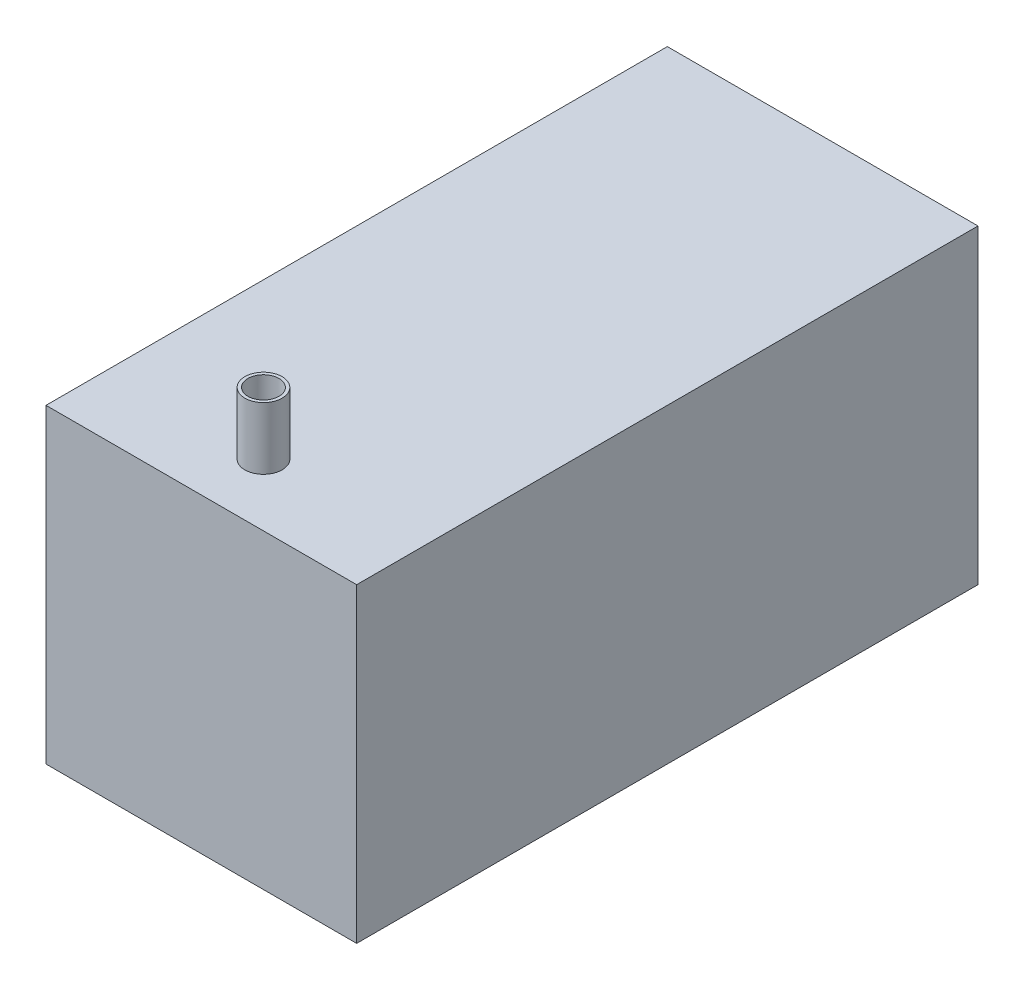
ISO-10303-21;
HEADER;
FILE_DESCRIPTION(('STEP AP214'),'2;1');
FILE_NAME('part.step','',(''),(''),'','','');
FILE_SCHEMA(('AUTOMOTIVE_DESIGN { 1 0 10303 214 1 1 1 1 }'));
ENDSEC;
DATA;
#1=APPLICATION_CONTEXT('core data for automotive mechanical design processes');
#2=APPLICATION_PROTOCOL_DEFINITION('international standard','automotive_design',2000,#1);
#3=PRODUCT_CONTEXT('',#1,'mechanical');
#4=PRODUCT('Part','Part','',(#3));
#5=PRODUCT_RELATED_PRODUCT_CATEGORY('part','',(#4));
#6=PRODUCT_DEFINITION_FORMATION('','',#4);
#7=PRODUCT_DEFINITION_CONTEXT('part definition',#1,'design');
#8=PRODUCT_DEFINITION('design','',#6,#7);
#9=PRODUCT_DEFINITION_SHAPE('','',#8);
#10=(LENGTH_UNIT() NAMED_UNIT(*) SI_UNIT(.MILLI.,.METRE.));
#11=(NAMED_UNIT(*) PLANE_ANGLE_UNIT() SI_UNIT($,.RADIAN.));
#12=(NAMED_UNIT(*) SI_UNIT($,.STERADIAN.) SOLID_ANGLE_UNIT());
#13=UNCERTAINTY_MEASURE_WITH_UNIT(LENGTH_MEASURE(1.E-05),#10,'distance_accuracy_value','');
#14=(GEOMETRIC_REPRESENTATION_CONTEXT(3) GLOBAL_UNCERTAINTY_ASSIGNED_CONTEXT((#13)) GLOBAL_UNIT_ASSIGNED_CONTEXT((#10,
#11,#12)) REPRESENTATION_CONTEXT('',''));
#15=CARTESIAN_POINT('',(0.,0.,0.));
#16=DIRECTION('',(0.,0.,1.));
#17=DIRECTION('',(1.,0.,0.));
#18=AXIS2_PLACEMENT_3D('',#15,#16,#17);
#19=CARTESIAN_POINT('',(50.,-10.,180.));
#20=DIRECTION('',(0.,1.,0.));
#21=DIRECTION('',(0.,0.,1.));
#22=AXIS2_PLACEMENT_3D('',#19,#20,#21);
#23=CYLINDRICAL_SURFACE('',#22,5.);
#24=CARTESIAN_POINT('',(50.,-0.999999999999999,180.));
#25=DIRECTION('',(0.,-1.,0.));
#26=DIRECTION('',(0.,0.,-1.));
#27=AXIS2_PLACEMENT_3D('',#24,#25,#26);
#28=CIRCLE('',#27,5.);
#29=CARTESIAN_POINT('',(50.,-0.999999999999999,175.));
#30=VERTEX_POINT('',#29);
#31=EDGE_CURVE('E188',#30,#30,#28,.T.);
#32=ORIENTED_EDGE('',*,*,#31,.T.);
#33=EDGE_LOOP('',(#32));
#34=FACE_BOUND('',#33,.T.);
#35=CARTESIAN_POINT('',(50.0000000000006,20.,179.999999999999));
#36=DIRECTION('',(0.,1.,0.));
#37=DIRECTION('',(0.,0.,1.));
#38=AXIS2_PLACEMENT_3D('',#35,#36,#37);
#39=CIRCLE('',#38,5.);
#40=CARTESIAN_POINT('',(50.0000000000006,20.,184.999999999999));
#41=VERTEX_POINT('',#40);
#42=EDGE_CURVE('E196',#41,#41,#39,.T.);
#43=ORIENTED_EDGE('',*,*,#42,.T.);
#44=EDGE_LOOP('',(#43));
#45=FACE_BOUND('',#44,.T.);
#46=ADVANCED_FACE('F63',(#34,#45),#23,.F.);
#47=CARTESIAN_POINT('',(1.,0.,199.));
#48=DIRECTION('',(1.,0.,0.));
#49=DIRECTION('',(0.,1.,0.));
#50=AXIS2_PLACEMENT_3D('',#47,#48,#49);
#51=PLANE('',#50);
#52=DIRECTION('',(0.,-1.,0.));
#53=VECTOR('',#52,1.);
#54=CARTESIAN_POINT('',(1.,0.,1.));
#55=LINE('',#54,#53);
#56=CARTESIAN_POINT('',(1.,-1.,1.));
#57=VERTEX_POINT('',#56);
#58=CARTESIAN_POINT('',(1.00000000000001,-99.,1.));
#59=VERTEX_POINT('',#58);
#60=EDGE_CURVE('E190',#57,#59,#55,.T.);
#61=ORIENTED_EDGE('',*,*,#60,.F.);
#62=DIRECTION('',(0.,0.,-1.));
#63=VECTOR('',#62,1.);
#64=CARTESIAN_POINT('',(1.,-1.,199.));
#65=LINE('',#64,#63);
#66=CARTESIAN_POINT('',(1.,-1.,199.));
#67=VERTEX_POINT('',#66);
#68=EDGE_CURVE('E158',#67,#57,#65,.T.);
#69=ORIENTED_EDGE('',*,*,#68,.F.);
#70=DIRECTION('',(0.,-1.,0.));
#71=VECTOR('',#70,1.);
#72=CARTESIAN_POINT('',(1.,0.,199.));
#73=LINE('',#72,#71);
#74=CARTESIAN_POINT('',(1.00000000000001,-99.,199.));
#75=VERTEX_POINT('',#74);
#76=EDGE_CURVE('E143',#67,#75,#73,.T.);
#77=ORIENTED_EDGE('',*,*,#76,.T.);
#78=DIRECTION('',(0.,0.,-1.));
#79=VECTOR('',#78,1.);
#80=CARTESIAN_POINT('',(1.00000000000001,-99.,199.));
#81=LINE('',#80,#79);
#82=EDGE_CURVE('E155',#75,#59,#81,.T.);
#83=ORIENTED_EDGE('',*,*,#82,.T.);
#84=EDGE_LOOP('',(#61,#69,#77,#83));
#85=FACE_BOUND('',#84,.T.);
#86=ADVANCED_FACE('F154',(#85),#51,.T.);
#87=CARTESIAN_POINT('',(0.,-99.,199.));
#88=DIRECTION('',(0.,1.,0.));
#89=DIRECTION('',(0.,0.,1.));
#90=AXIS2_PLACEMENT_3D('',#87,#88,#89);
#91=PLANE('',#90);
#92=DIRECTION('',(1.,0.,0.));
#93=VECTOR('',#92,1.);
#94=CARTESIAN_POINT('',(0.,-99.,1.));
#95=LINE('',#94,#93);
#96=CARTESIAN_POINT('',(99.,-99.,1.));
#97=VERTEX_POINT('',#96);
#98=EDGE_CURVE('E162',#59,#97,#95,.T.);
#99=ORIENTED_EDGE('',*,*,#98,.F.);
#100=ORIENTED_EDGE('',*,*,#82,.F.);
#101=DIRECTION('',(1.,0.,0.));
#102=VECTOR('',#101,1.);
#103=CARTESIAN_POINT('',(0.,-99.,199.));
#104=LINE('',#103,#102);
#105=CARTESIAN_POINT('',(99.,-99.,199.));
#106=VERTEX_POINT('',#105);
#107=EDGE_CURVE('E139',#75,#106,#104,.T.);
#108=ORIENTED_EDGE('',*,*,#107,.T.);
#109=DIRECTION('',(0.,0.,-1.));
#110=VECTOR('',#109,1.);
#111=CARTESIAN_POINT('',(99.,-99.,199.));
#112=LINE('',#111,#110);
#113=EDGE_CURVE('E164',#106,#97,#112,.T.);
#114=ORIENTED_EDGE('',*,*,#113,.T.);
#115=EDGE_LOOP('',(#99,#100,#108,#114));
#116=FACE_BOUND('',#115,.T.);
#117=ADVANCED_FACE('F161',(#116),#91,.T.);
#118=CARTESIAN_POINT('',(99.,0.,199.));
#119=DIRECTION('',(-1.,0.,0.));
#120=DIRECTION('',(0.,-1.,0.));
#121=AXIS2_PLACEMENT_3D('',#118,#119,#120);
#122=PLANE('',#121);
#123=DIRECTION('',(0.,1.,0.));
#124=VECTOR('',#123,1.);
#125=CARTESIAN_POINT('',(99.,0.,1.));
#126=LINE('',#125,#124);
#127=CARTESIAN_POINT('',(99.,-1.,1.));
#128=VERTEX_POINT('',#127);
#129=EDGE_CURVE('E207',#97,#128,#126,.T.);
#130=ORIENTED_EDGE('',*,*,#129,.F.);
#131=ORIENTED_EDGE('',*,*,#113,.F.);
#132=DIRECTION('',(0.,1.,0.));
#133=VECTOR('',#132,1.);
#134=CARTESIAN_POINT('',(99.,0.,199.));
#135=LINE('',#134,#133);
#136=CARTESIAN_POINT('',(99.,-1.,199.));
#137=VERTEX_POINT('',#136);
#138=EDGE_CURVE('E144',#106,#137,#135,.T.);
#139=ORIENTED_EDGE('',*,*,#138,.T.);
#140=DIRECTION('',(0.,0.,-1.));
#141=VECTOR('',#140,1.);
#142=CARTESIAN_POINT('',(99.,-1.,199.));
#143=LINE('',#142,#141);
#144=EDGE_CURVE('E169',#137,#128,#143,.T.);
#145=ORIENTED_EDGE('',*,*,#144,.T.);
#146=EDGE_LOOP('',(#130,#131,#139,#145));
#147=FACE_BOUND('',#146,.T.);
#148=ADVANCED_FACE('F215',(#147),#122,.T.);
#149=CARTESIAN_POINT('',(0.,-1.,199.));
#150=DIRECTION('',(0.,-1.,0.));
#151=DIRECTION('',(0.,0.,-1.));
#152=AXIS2_PLACEMENT_3D('',#149,#150,#151);
#153=PLANE('',#152);
#154=ORIENTED_EDGE('',*,*,#31,.F.);
#155=EDGE_LOOP('',(#154));
#156=FACE_BOUND('',#155,.T.);
#157=DIRECTION('',(-1.,0.,0.));
#158=VECTOR('',#157,1.);
#159=CARTESIAN_POINT('',(0.,-1.,1.));
#160=LINE('',#159,#158);
#161=EDGE_CURVE('E159',#128,#57,#160,.T.);
#162=ORIENTED_EDGE('',*,*,#161,.F.);
#163=ORIENTED_EDGE('',*,*,#144,.F.);
#164=DIRECTION('',(-1.,0.,0.));
#165=VECTOR('',#164,1.);
#166=CARTESIAN_POINT('',(0.,-1.,199.));
#167=LINE('',#166,#165);
#168=EDGE_CURVE('E204',#137,#67,#167,.T.);
#169=ORIENTED_EDGE('',*,*,#168,.T.);
#170=ORIENTED_EDGE('',*,*,#68,.T.);
#171=EDGE_LOOP('',(#162,#163,#169,#170));
#172=FACE_BOUND('',#171,.T.);
#173=ADVANCED_FACE('F217',(#156,#172),#153,.T.);
#174=CARTESIAN_POINT('',(1.00000000000001,-99.,199.));
#175=DIRECTION('',(0.,0.,1.));
#176=DIRECTION('',(1.,0.,0.));
#177=AXIS2_PLACEMENT_3D('',#174,#175,#176);
#178=PLANE('',#177);
#179=ORIENTED_EDGE('',*,*,#76,.F.);
#180=ORIENTED_EDGE('',*,*,#168,.F.);
#181=ORIENTED_EDGE('',*,*,#138,.F.);
#182=ORIENTED_EDGE('',*,*,#107,.F.);
#183=EDGE_LOOP('',(#179,#180,#181,#182));
#184=FACE_BOUND('',#183,.T.);
#185=ADVANCED_FACE('F141',(#184),#178,.F.);
#186=CARTESIAN_POINT('',(1.00000000000001,-99.,1.));
#187=DIRECTION('',(0.,0.,1.));
#188=DIRECTION('',(1.,0.,0.));
#189=AXIS2_PLACEMENT_3D('',#186,#187,#188);
#190=PLANE('',#189);
#191=ORIENTED_EDGE('',*,*,#60,.T.);
#192=ORIENTED_EDGE('',*,*,#98,.T.);
#193=ORIENTED_EDGE('',*,*,#129,.T.);
#194=ORIENTED_EDGE('',*,*,#161,.T.);
#195=EDGE_LOOP('',(#191,#192,#193,#194));
#196=FACE_BOUND('',#195,.T.);
#197=ADVANCED_FACE('F219',(#196),#190,.T.);
#198=CARTESIAN_POINT('',(50.0000000000006,20.,179.999999999999));
#199=DIRECTION('',(0.,1.,0.));
#200=DIRECTION('',(0.,0.,1.));
#201=AXIS2_PLACEMENT_3D('',#198,#199,#200);
#202=PLANE('',#201);
#203=CARTESIAN_POINT('',(50.0000000000006,20.,179.999999999999));
#204=DIRECTION('',(0.,1.,0.));
#205=DIRECTION('',(1.,0.,0.));
#206=AXIS2_PLACEMENT_3D('',#203,#204,#205);
#207=CIRCLE('',#206,6.);
#208=CARTESIAN_POINT('',(56.0000000000006,20.,179.999999999999));
#209=VERTEX_POINT('',#208);
#210=EDGE_CURVE('E191',#209,#209,#207,.T.);
#211=ORIENTED_EDGE('',*,*,#210,.T.);
#212=EDGE_LOOP('',(#211));
#213=FACE_BOUND('',#212,.T.);
#214=ORIENTED_EDGE('',*,*,#42,.F.);
#215=EDGE_LOOP('',(#214));
#216=FACE_BOUND('',#215,.T.);
#217=ADVANCED_FACE('F221',(#213,#216),#202,.T.);
#218=CARTESIAN_POINT('',(50.0000000000006,20.,179.999999999999));
#219=DIRECTION('',(0.,-1.,0.));
#220=DIRECTION('',(0.,0.,-1.));
#221=AXIS2_PLACEMENT_3D('',#218,#219,#220);
#222=CYLINDRICAL_SURFACE('',#221,6.);
#223=ORIENTED_EDGE('',*,*,#210,.F.);
#224=EDGE_LOOP('',(#223));
#225=FACE_BOUND('',#224,.T.);
#226=CARTESIAN_POINT('',(50.0000000000006,0.,179.999999999999));
#227=DIRECTION('',(0.,-1.,0.));
#228=DIRECTION('',(0.,0.,-1.));
#229=AXIS2_PLACEMENT_3D('',#226,#227,#228);
#230=CIRCLE('',#229,6.);
#231=CARTESIAN_POINT('',(50.0000000000006,0.,173.999999999999));
#232=VERTEX_POINT('',#231);
#233=EDGE_CURVE('E12',#232,#232,#230,.F.);
#234=ORIENTED_EDGE('',*,*,#233,.T.);
#235=EDGE_LOOP('',(#234));
#236=FACE_BOUND('',#235,.T.);
#237=ADVANCED_FACE('F228',(#225,#236),#222,.T.);
#238=CARTESIAN_POINT('',(0.,-100.,200.));
#239=DIRECTION('',(0.,1.,0.));
#240=DIRECTION('',(0.,0.,1.));
#241=AXIS2_PLACEMENT_3D('',#238,#239,#240);
#242=PLANE('',#241);
#243=DIRECTION('',(1.,0.,0.));
#244=VECTOR('',#243,1.);
#245=CARTESIAN_POINT('',(0.,-100.,0.));
#246=LINE('',#245,#244);
#247=CARTESIAN_POINT('',(0.,-100.,0.));
#248=VERTEX_POINT('',#247);
#249=CARTESIAN_POINT('',(100.,-100.,0.));
#250=VERTEX_POINT('',#249);
#251=EDGE_CURVE('E167',#248,#250,#246,.T.);
#252=ORIENTED_EDGE('',*,*,#251,.T.);
#253=DIRECTION('',(0.,0.,-1.));
#254=VECTOR('',#253,1.);
#255=CARTESIAN_POINT('',(100.,-100.,200.));
#256=LINE('',#255,#254);
#257=CARTESIAN_POINT('',(100.,-100.,200.));
#258=VERTEX_POINT('',#257);
#259=EDGE_CURVE('E186',#258,#250,#256,.T.);
#260=ORIENTED_EDGE('',*,*,#259,.F.);
#261=DIRECTION('',(1.,0.,0.));
#262=VECTOR('',#261,1.);
#263=CARTESIAN_POINT('',(0.,-100.,200.));
#264=LINE('',#263,#262);
#265=CARTESIAN_POINT('',(0.,-100.,200.));
#266=VERTEX_POINT('',#265);
#267=EDGE_CURVE('E112',#266,#258,#264,.T.);
#268=ORIENTED_EDGE('',*,*,#267,.F.);
#269=DIRECTION('',(0.,0.,-1.));
#270=VECTOR('',#269,1.);
#271=CARTESIAN_POINT('',(0.,-100.,200.));
#272=LINE('',#271,#270);
#273=EDGE_CURVE('E72',#266,#248,#272,.T.);
#274=ORIENTED_EDGE('',*,*,#273,.T.);
#275=EDGE_LOOP('',(#252,#260,#268,#274));
#276=FACE_BOUND('',#275,.T.);
#277=ADVANCED_FACE('F241',(#276),#242,.F.);
#278=CARTESIAN_POINT('',(100.,0.,200.));
#279=DIRECTION('',(-1.,0.,0.));
#280=DIRECTION('',(0.,-1.,0.));
#281=AXIS2_PLACEMENT_3D('',#278,#279,#280);
#282=PLANE('',#281);
#283=DIRECTION('',(0.,1.,0.));
#284=VECTOR('',#283,1.);
#285=CARTESIAN_POINT('',(100.,0.,0.));
#286=LINE('',#285,#284);
#287=CARTESIAN_POINT('',(100.,0.,0.));
#288=VERTEX_POINT('',#287);
#289=EDGE_CURVE('E98',#250,#288,#286,.T.);
#290=ORIENTED_EDGE('',*,*,#289,.T.);
#291=DIRECTION('',(0.,0.,-1.));
#292=VECTOR('',#291,1.);
#293=CARTESIAN_POINT('',(100.,0.,200.));
#294=LINE('',#293,#292);
#295=CARTESIAN_POINT('',(100.,0.,200.));
#296=VERTEX_POINT('',#295);
#297=EDGE_CURVE('E184',#296,#288,#294,.T.);
#298=ORIENTED_EDGE('',*,*,#297,.F.);
#299=DIRECTION('',(0.,1.,0.));
#300=VECTOR('',#299,1.);
#301=CARTESIAN_POINT('',(100.,0.,200.));
#302=LINE('',#301,#300);
#303=EDGE_CURVE('E176',#258,#296,#302,.T.);
#304=ORIENTED_EDGE('',*,*,#303,.F.);
#305=ORIENTED_EDGE('',*,*,#259,.T.);
#306=EDGE_LOOP('',(#290,#298,#304,#305));
#307=FACE_BOUND('',#306,.T.);
#308=ADVANCED_FACE('F246',(#307),#282,.F.);
#309=CARTESIAN_POINT('',(0.,-100.,200.));
#310=DIRECTION('',(0.,0.,1.));
#311=DIRECTION('',(1.,0.,0.));
#312=AXIS2_PLACEMENT_3D('',#309,#310,#311);
#313=PLANE('',#312);
#314=DIRECTION('',(0.,-1.,0.));
#315=VECTOR('',#314,1.);
#316=CARTESIAN_POINT('',(0.,0.,200.));
#317=LINE('',#316,#315);
#318=CARTESIAN_POINT('',(0.,0.,200.));
#319=VERTEX_POINT('',#318);
#320=EDGE_CURVE('E173',#319,#266,#317,.T.);
#321=ORIENTED_EDGE('',*,*,#320,.T.);
#322=ORIENTED_EDGE('',*,*,#267,.T.);
#323=ORIENTED_EDGE('',*,*,#303,.T.);
#324=DIRECTION('',(-1.,0.,0.));
#325=VECTOR('',#324,1.);
#326=CARTESIAN_POINT('',(0.,0.,200.));
#327=LINE('',#326,#325);
#328=EDGE_CURVE('E80',#296,#319,#327,.T.);
#329=ORIENTED_EDGE('',*,*,#328,.T.);
#330=EDGE_LOOP('',(#321,#322,#323,#329));
#331=FACE_BOUND('',#330,.T.);
#332=ADVANCED_FACE('F262',(#331),#313,.T.);
#333=CARTESIAN_POINT('',(0.,0.,200.));
#334=DIRECTION('',(1.,0.,0.));
#335=DIRECTION('',(0.,1.,0.));
#336=AXIS2_PLACEMENT_3D('',#333,#334,#335);
#337=PLANE('',#336);
#338=DIRECTION('',(0.,-1.,0.));
#339=VECTOR('',#338,1.);
#340=CARTESIAN_POINT('',(0.,0.,0.));
#341=LINE('',#340,#339);
#342=CARTESIAN_POINT('',(0.,0.,0.));
#343=VERTEX_POINT('',#342);
#344=EDGE_CURVE('E163',#343,#248,#341,.T.);
#345=ORIENTED_EDGE('',*,*,#344,.T.);
#346=ORIENTED_EDGE('',*,*,#273,.F.);
#347=ORIENTED_EDGE('',*,*,#320,.F.);
#348=DIRECTION('',(0.,0.,-1.));
#349=VECTOR('',#348,1.);
#350=CARTESIAN_POINT('',(0.,0.,200.));
#351=LINE('',#350,#349);
#352=EDGE_CURVE('E178',#319,#343,#351,.T.);
#353=ORIENTED_EDGE('',*,*,#352,.T.);
#354=EDGE_LOOP('',(#345,#346,#347,#353));
#355=FACE_BOUND('',#354,.T.);
#356=ADVANCED_FACE('F65',(#355),#337,.F.);
#357=CARTESIAN_POINT('',(0.,-100.,0.));
#358=DIRECTION('',(0.,0.,1.));
#359=DIRECTION('',(1.,0.,0.));
#360=AXIS2_PLACEMENT_3D('',#357,#358,#359);
#361=PLANE('',#360);
#362=ORIENTED_EDGE('',*,*,#344,.F.);
#363=DIRECTION('',(-1.,0.,0.));
#364=VECTOR('',#363,1.);
#365=CARTESIAN_POINT('',(0.,0.,0.));
#366=LINE('',#365,#364);
#367=EDGE_CURVE('E104',#288,#343,#366,.T.);
#368=ORIENTED_EDGE('',*,*,#367,.F.);
#369=ORIENTED_EDGE('',*,*,#289,.F.);
#370=ORIENTED_EDGE('',*,*,#251,.F.);
#371=EDGE_LOOP('',(#362,#368,#369,#370));
#372=FACE_BOUND('',#371,.T.);
#373=ADVANCED_FACE('F252',(#372),#361,.F.);
#374=CARTESIAN_POINT('',(0.,0.,200.));
#375=DIRECTION('',(0.,-1.,0.));
#376=DIRECTION('',(0.,0.,-1.));
#377=AXIS2_PLACEMENT_3D('',#374,#375,#376);
#378=PLANE('',#377);
#379=ORIENTED_EDGE('',*,*,#367,.T.);
#380=ORIENTED_EDGE('',*,*,#352,.F.);
#381=ORIENTED_EDGE('',*,*,#328,.F.);
#382=ORIENTED_EDGE('',*,*,#297,.T.);
#383=EDGE_LOOP('',(#379,#380,#381,#382));
#384=FACE_BOUND('',#383,.T.);
#385=ORIENTED_EDGE('',*,*,#233,.F.);
#386=EDGE_LOOP('',(#385));
#387=FACE_BOUND('',#386,.T.);
#388=ADVANCED_FACE('F250',(#384,#387),#378,.F.);
#389=CLOSED_SHELL('',(#46,#86,#117,#148,#173,#185,#197,#217,#237,#277,#308,#332,#356,#373,#388));
#390=MANIFOLD_SOLID_BREP('B2',#389);
#391=ADVANCED_BREP_SHAPE_REPRESENTATION('',(#18,#390),#14);
#392=SHAPE_DEFINITION_REPRESENTATION(#9,#391);
ENDSEC;
END-ISO-10303-21;
